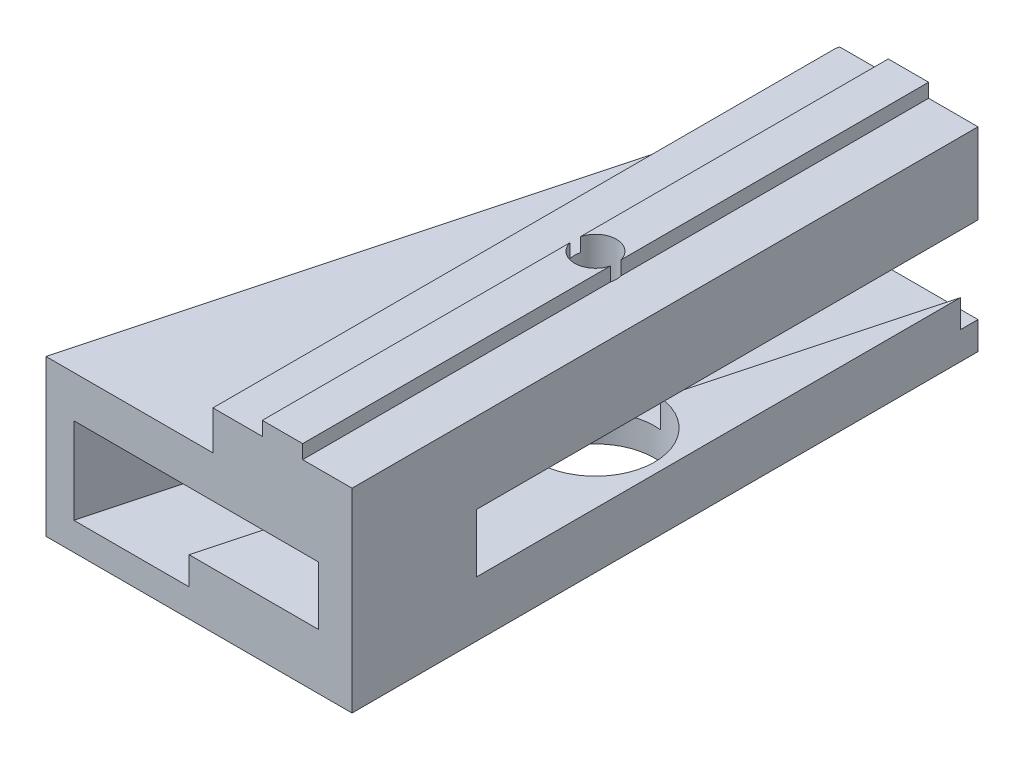
ISO-10303-21;
HEADER;
FILE_DESCRIPTION(('STEP AP214'),'2;1');
FILE_NAME('part.step','',(''),(''),'','','');
FILE_SCHEMA(('AUTOMOTIVE_DESIGN { 1 0 10303 214 1 1 1 1 }'));
ENDSEC;
DATA;
#1=APPLICATION_CONTEXT('core data for automotive mechanical design processes');
#2=APPLICATION_PROTOCOL_DEFINITION('international standard','automotive_design',2000,#1);
#3=PRODUCT_CONTEXT('',#1,'mechanical');
#4=PRODUCT('Part','Part','',(#3));
#5=PRODUCT_RELATED_PRODUCT_CATEGORY('part','',(#4));
#6=PRODUCT_DEFINITION_FORMATION('','',#4);
#7=PRODUCT_DEFINITION_CONTEXT('part definition',#1,'design');
#8=PRODUCT_DEFINITION('design','',#6,#7);
#9=PRODUCT_DEFINITION_SHAPE('','',#8);
#10=(LENGTH_UNIT() NAMED_UNIT(*) SI_UNIT(.MILLI.,.METRE.));
#11=(NAMED_UNIT(*) PLANE_ANGLE_UNIT() SI_UNIT($,.RADIAN.));
#12=(NAMED_UNIT(*) SI_UNIT($,.STERADIAN.) SOLID_ANGLE_UNIT());
#13=UNCERTAINTY_MEASURE_WITH_UNIT(LENGTH_MEASURE(1.E-05),#10,'distance_accuracy_value','');
#14=(GEOMETRIC_REPRESENTATION_CONTEXT(3) GLOBAL_UNCERTAINTY_ASSIGNED_CONTEXT((#13)) GLOBAL_UNIT_ASSIGNED_CONTEXT((#10,
#11,#12)) REPRESENTATION_CONTEXT('',''));
#15=CARTESIAN_POINT('',(0.,0.,0.));
#16=DIRECTION('',(0.,0.,1.));
#17=DIRECTION('',(1.,0.,0.));
#18=AXIS2_PLACEMENT_3D('',#15,#16,#17);
#19=CARTESIAN_POINT('',(11.,0.,22.5));
#20=DIRECTION('',(-1.,0.,0.));
#21=DIRECTION('',(0.,0.,1.));
#22=AXIS2_PLACEMENT_3D('',#19,#20,#21);
#23=PLANE('',#22);
#24=DIRECTION('',(0.,1.,0.));
#25=VECTOR('',#24,1.);
#26=CARTESIAN_POINT('',(11.,0.,-22.5));
#27=LINE('',#26,#25);
#28=CARTESIAN_POINT('',(11.,0.,-22.5));
#29=VERTEX_POINT('',#28);
#30=CARTESIAN_POINT('',(11.,2.,-22.5));
#31=VERTEX_POINT('',#30);
#32=EDGE_CURVE('E304',#29,#31,#27,.T.);
#33=ORIENTED_EDGE('',*,*,#32,.T.);
#34=DIRECTION('',(0.,0.,1.));
#35=VECTOR('',#34,1.);
#36=CARTESIAN_POINT('',(11.,2.,22.5));
#37=LINE('',#36,#35);
#38=CARTESIAN_POINT('',(11.,2.,-21.2313897101272));
#39=VERTEX_POINT('',#38);
#40=EDGE_CURVE('E217',#31,#39,#37,.T.);
#41=ORIENTED_EDGE('',*,*,#40,.T.);
#42=DIRECTION('',(0.,1.,0.));
#43=VECTOR('',#42,1.);
#44=CARTESIAN_POINT('',(11.,0.,-21.2313897101272));
#45=LINE('',#44,#43);
#46=CARTESIAN_POINT('',(11.,4.,-21.2313897101272));
#47=VERTEX_POINT('',#46);
#48=EDGE_CURVE('E384',#39,#47,#45,.T.);
#49=ORIENTED_EDGE('',*,*,#48,.T.);
#50=DIRECTION('',(0.,0.,1.));
#51=VECTOR('',#50,1.);
#52=CARTESIAN_POINT('',(11.,4.,22.5));
#53=LINE('',#52,#51);
#54=CARTESIAN_POINT('',(11.,4.,13.5419400362791));
#55=VERTEX_POINT('',#54);
#56=EDGE_CURVE('E242',#47,#55,#53,.T.);
#57=ORIENTED_EDGE('',*,*,#56,.T.);
#58=DIRECTION('',(0.,-1.,0.));
#59=VECTOR('',#58,1.);
#60=CARTESIAN_POINT('',(11.,0.,13.5419400362791));
#61=LINE('',#60,#59);
#62=CARTESIAN_POINT('',(11.,8.2,13.5419400362791));
#63=VERTEX_POINT('',#62);
#64=EDGE_CURVE('E253',#63,#55,#61,.T.);
#65=ORIENTED_EDGE('',*,*,#64,.F.);
#66=DIRECTION('',(0.,0.,1.));
#67=VECTOR('',#66,1.);
#68=CARTESIAN_POINT('',(11.,8.2,22.5));
#69=LINE('',#68,#67);
#70=CARTESIAN_POINT('',(11.,8.2,-22.5));
#71=VERTEX_POINT('',#70);
#72=EDGE_CURVE('E249',#71,#63,#69,.T.);
#73=ORIENTED_EDGE('',*,*,#72,.F.);
#74=CARTESIAN_POINT('',(11.,14.,-22.5));
#75=VERTEX_POINT('',#74);
#76=EDGE_CURVE('E303',#71,#75,#27,.T.);
#77=ORIENTED_EDGE('',*,*,#76,.T.);
#78=DIRECTION('',(0.,0.,-1.));
#79=VECTOR('',#78,1.);
#80=CARTESIAN_POINT('',(11.,14.,22.5));
#81=LINE('',#80,#79);
#82=CARTESIAN_POINT('',(11.,14.,22.5));
#83=VERTEX_POINT('',#82);
#84=EDGE_CURVE('E336',#83,#75,#81,.T.);
#85=ORIENTED_EDGE('',*,*,#84,.F.);
#86=DIRECTION('',(0.,1.,0.));
#87=VECTOR('',#86,1.);
#88=CARTESIAN_POINT('',(11.,0.,22.5));
#89=LINE('',#88,#87);
#90=CARTESIAN_POINT('',(11.,0.,22.5));
#91=VERTEX_POINT('',#90);
#92=EDGE_CURVE('E288',#91,#83,#89,.T.);
#93=ORIENTED_EDGE('',*,*,#92,.F.);
#94=DIRECTION('',(0.,0.,-1.));
#95=VECTOR('',#94,1.);
#96=CARTESIAN_POINT('',(11.,0.,22.5));
#97=LINE('',#96,#95);
#98=EDGE_CURVE('E339',#91,#29,#97,.T.);
#99=ORIENTED_EDGE('',*,*,#98,.T.);
#100=EDGE_LOOP('',(#33,#41,#49,#57,#65,#73,#77,#85,#93,#99));
#101=FACE_BOUND('',#100,.T.);
#102=ADVANCED_FACE('F35',(#101),#23,.F.);
#103=CARTESIAN_POINT('',(0.,0.,22.5));
#104=DIRECTION('',(0.,0.,1.));
#105=DIRECTION('',(1.,0.,0.));
#106=AXIS2_PLACEMENT_3D('',#103,#104,#105);
#107=PLANE('',#106);
#108=DIRECTION('',(0.,1.,0.));
#109=VECTOR('',#108,1.);
#110=CARTESIAN_POINT('',(-0.717790556719333,0.,22.5));
#111=LINE('',#110,#109);
#112=CARTESIAN_POINT('',(-0.717790556719331,2.,22.5));
#113=VERTEX_POINT('',#112);
#114=CARTESIAN_POINT('',(-0.717790556719333,4.,22.5));
#115=VERTEX_POINT('',#114);
#116=EDGE_CURVE('E50',#113,#115,#111,.T.);
#117=ORIENTED_EDGE('',*,*,#116,.F.);
#118=DIRECTION('',(1.,0.,0.));
#119=VECTOR('',#118,1.);
#120=CARTESIAN_POINT('',(0.,2.,22.5));
#121=LINE('',#120,#119);
#122=CARTESIAN_POINT('',(-9.,2.,22.5));
#123=VERTEX_POINT('',#122);
#124=EDGE_CURVE('E207',#123,#113,#121,.T.);
#125=ORIENTED_EDGE('',*,*,#124,.F.);
#126=DIRECTION('',(0.,-1.,0.));
#127=VECTOR('',#126,1.);
#128=CARTESIAN_POINT('',(-9.,8.2,22.5));
#129=LINE('',#128,#127);
#130=CARTESIAN_POINT('',(-9.,8.2,22.5));
#131=VERTEX_POINT('',#130);
#132=EDGE_CURVE('E192',#131,#123,#129,.T.);
#133=ORIENTED_EDGE('',*,*,#132,.F.);
#134=DIRECTION('',(1.,0.,0.));
#135=VECTOR('',#134,1.);
#136=CARTESIAN_POINT('',(0.,8.2,22.5));
#137=LINE('',#136,#135);
#138=CARTESIAN_POINT('',(8.59969506697142,8.2,22.5));
#139=VERTEX_POINT('',#138);
#140=EDGE_CURVE('E251',#131,#139,#137,.T.);
#141=ORIENTED_EDGE('',*,*,#140,.T.);
#142=DIRECTION('',(0.,-1.,0.));
#143=VECTOR('',#142,1.);
#144=CARTESIAN_POINT('',(8.59969506697141,0.,22.5));
#145=LINE('',#144,#143);
#146=CARTESIAN_POINT('',(8.59969506697142,4.,22.5));
#147=VERTEX_POINT('',#146);
#148=EDGE_CURVE('E353',#139,#147,#145,.T.);
#149=ORIENTED_EDGE('',*,*,#148,.T.);
#150=DIRECTION('',(1.,0.,0.));
#151=VECTOR('',#150,1.);
#152=CARTESIAN_POINT('',(0.,4.,22.5));
#153=LINE('',#152,#151);
#154=EDGE_CURVE('E244',#115,#147,#153,.T.);
#155=ORIENTED_EDGE('',*,*,#154,.F.);
#156=EDGE_LOOP('',(#117,#125,#133,#141,#149,#155));
#157=FACE_BOUND('',#156,.T.);
#158=DIRECTION('',(0.,1.,0.));
#159=VECTOR('',#158,1.);
#160=CARTESIAN_POINT('',(0.999999999999999,14.,22.5));
#161=LINE('',#160,#159);
#162=CARTESIAN_POINT('',(1.,11.2,22.5));
#163=VERTEX_POINT('',#162);
#164=CARTESIAN_POINT('',(0.999999999999999,14.,22.5));
#165=VERTEX_POINT('',#164);
#166=EDGE_CURVE('E219',#163,#165,#161,.T.);
#167=ORIENTED_EDGE('',*,*,#166,.F.);
#168=DIRECTION('',(1.,0.,0.));
#169=VECTOR('',#168,1.);
#170=CARTESIAN_POINT('',(-11.,11.2,22.5));
#171=LINE('',#170,#169);
#172=CARTESIAN_POINT('',(-11.,11.2,22.5));
#173=VERTEX_POINT('',#172);
#174=EDGE_CURVE('E216',#173,#163,#171,.T.);
#175=ORIENTED_EDGE('',*,*,#174,.F.);
#176=DIRECTION('',(0.,-1.,0.));
#177=VECTOR('',#176,1.);
#178=CARTESIAN_POINT('',(-11.,14.,22.5));
#179=LINE('',#178,#177);
#180=CARTESIAN_POINT('',(-11.,0.,22.5));
#181=VERTEX_POINT('',#180);
#182=EDGE_CURVE('E283',#173,#181,#179,.T.);
#183=ORIENTED_EDGE('',*,*,#182,.T.);
#184=DIRECTION('',(1.,0.,0.));
#185=VECTOR('',#184,1.);
#186=CARTESIAN_POINT('',(-11.,0.,22.5));
#187=LINE('',#186,#185);
#188=EDGE_CURVE('E285',#181,#91,#187,.T.);
#189=ORIENTED_EDGE('',*,*,#188,.T.);
#190=ORIENTED_EDGE('',*,*,#92,.T.);
#191=DIRECTION('',(-1.,0.,0.));
#192=VECTOR('',#191,1.);
#193=CARTESIAN_POINT('',(11.,14.,22.5));
#194=LINE('',#193,#192);
#195=CARTESIAN_POINT('',(7.45,14.,22.5));
#196=VERTEX_POINT('',#195);
#197=EDGE_CURVE('E290',#83,#196,#194,.T.);
#198=ORIENTED_EDGE('',*,*,#197,.T.);
#199=DIRECTION('',(0.,1.,0.));
#200=VECTOR('',#199,1.);
#201=CARTESIAN_POINT('',(7.45,14.,22.5));
#202=LINE('',#201,#200);
#203=CARTESIAN_POINT('',(7.45,15.,22.5));
#204=VERTEX_POINT('',#203);
#205=EDGE_CURVE('E292',#196,#204,#202,.T.);
#206=ORIENTED_EDGE('',*,*,#205,.T.);
#207=DIRECTION('',(-1.,0.,0.));
#208=VECTOR('',#207,1.);
#209=CARTESIAN_POINT('',(7.45,15.,22.5));
#210=LINE('',#209,#208);
#211=CARTESIAN_POINT('',(4.55,15.,22.5));
#212=VERTEX_POINT('',#211);
#213=EDGE_CURVE('E294',#204,#212,#210,.T.);
#214=ORIENTED_EDGE('',*,*,#213,.T.);
#215=DIRECTION('',(0.,-1.,0.));
#216=VECTOR('',#215,1.);
#217=CARTESIAN_POINT('',(4.55,15.,22.5));
#218=LINE('',#217,#216);
#219=CARTESIAN_POINT('',(4.55,14.,22.5));
#220=VERTEX_POINT('',#219);
#221=EDGE_CURVE('E296',#212,#220,#218,.T.);
#222=ORIENTED_EDGE('',*,*,#221,.T.);
#223=DIRECTION('',(-1.,0.,0.));
#224=VECTOR('',#223,1.);
#225=CARTESIAN_POINT('',(4.55,14.,22.5));
#226=LINE('',#225,#224);
#227=EDGE_CURVE('E298',#220,#165,#226,.T.);
#228=ORIENTED_EDGE('',*,*,#227,.T.);
#229=EDGE_LOOP('',(#167,#175,#183,#189,#190,#198,#206,#214,#222,#228));
#230=FACE_BOUND('',#229,.T.);
#231=ADVANCED_FACE('F213',(#157,#230),#107,.T.);
#232=CARTESIAN_POINT('',(0.,0.,-22.5));
#233=DIRECTION('',(0.,0.,1.));
#234=DIRECTION('',(1.,0.,0.));
#235=AXIS2_PLACEMENT_3D('',#232,#233,#234);
#236=PLANE('',#235);
#237=DIRECTION('',(0.,1.,0.));
#238=VECTOR('',#237,1.);
#239=CARTESIAN_POINT('',(3.05771365940056,0.,-22.5));
#240=LINE('',#239,#238);
#241=CARTESIAN_POINT('',(3.05771365940056,2.,-22.5));
#242=VERTEX_POINT('',#241);
#243=CARTESIAN_POINT('',(3.05771365940055,8.2,-22.5));
#244=VERTEX_POINT('',#243);
#245=EDGE_CURVE('E345',#242,#244,#240,.T.);
#246=ORIENTED_EDGE('',*,*,#245,.F.);
#247=DIRECTION('',(1.,0.,0.));
#248=VECTOR('',#247,1.);
#249=CARTESIAN_POINT('',(0.,2.,-22.5));
#250=LINE('',#249,#248);
#251=EDGE_CURVE('E209',#242,#31,#250,.T.);
#252=ORIENTED_EDGE('',*,*,#251,.T.);
#253=ORIENTED_EDGE('',*,*,#32,.F.);
#254=DIRECTION('',(1.,0.,0.));
#255=VECTOR('',#254,1.);
#256=CARTESIAN_POINT('',(-11.,0.,-22.5));
#257=LINE('',#256,#255);
#258=CARTESIAN_POINT('',(1.05771365940055,0.,-22.5));
#259=VERTEX_POINT('',#258);
#260=EDGE_CURVE('E282',#259,#29,#257,.T.);
#261=ORIENTED_EDGE('',*,*,#260,.F.);
#262=DIRECTION('',(0.,-1.,0.));
#263=VECTOR('',#262,1.);
#264=CARTESIAN_POINT('',(1.05771365940055,15.,-22.5));
#265=LINE('',#264,#263);
#266=CARTESIAN_POINT('',(1.05771365940055,14.,-22.5));
#267=VERTEX_POINT('',#266);
#268=EDGE_CURVE('E233',#267,#259,#265,.T.);
#269=ORIENTED_EDGE('',*,*,#268,.F.);
#270=DIRECTION('',(-1.,0.,0.));
#271=VECTOR('',#270,1.);
#272=CARTESIAN_POINT('',(4.55,14.,-22.5));
#273=LINE('',#272,#271);
#274=CARTESIAN_POINT('',(4.55,14.,-22.5));
#275=VERTEX_POINT('',#274);
#276=EDGE_CURVE('E286',#275,#267,#273,.T.);
#277=ORIENTED_EDGE('',*,*,#276,.F.);
#278=DIRECTION('',(0.,-1.,0.));
#279=VECTOR('',#278,1.);
#280=CARTESIAN_POINT('',(4.55,15.,-22.5));
#281=LINE('',#280,#279);
#282=CARTESIAN_POINT('',(4.55,15.,-22.5));
#283=VERTEX_POINT('',#282);
#284=EDGE_CURVE('E316',#283,#275,#281,.T.);
#285=ORIENTED_EDGE('',*,*,#284,.F.);
#286=DIRECTION('',(-1.,0.,0.));
#287=VECTOR('',#286,1.);
#288=CARTESIAN_POINT('',(7.45,15.,-22.5));
#289=LINE('',#288,#287);
#290=CARTESIAN_POINT('',(7.45,15.,-22.5));
#291=VERTEX_POINT('',#290);
#292=EDGE_CURVE('E313',#291,#283,#289,.T.);
#293=ORIENTED_EDGE('',*,*,#292,.F.);
#294=DIRECTION('',(0.,1.,0.));
#295=VECTOR('',#294,1.);
#296=CARTESIAN_POINT('',(7.45,14.,-22.5));
#297=LINE('',#296,#295);
#298=CARTESIAN_POINT('',(7.45,14.,-22.5));
#299=VERTEX_POINT('',#298);
#300=EDGE_CURVE('E310',#299,#291,#297,.T.);
#301=ORIENTED_EDGE('',*,*,#300,.F.);
#302=DIRECTION('',(-1.,0.,0.));
#303=VECTOR('',#302,1.);
#304=CARTESIAN_POINT('',(11.,14.,-22.5));
#305=LINE('',#304,#303);
#306=EDGE_CURVE('E307',#75,#299,#305,.T.);
#307=ORIENTED_EDGE('',*,*,#306,.F.);
#308=ORIENTED_EDGE('',*,*,#76,.F.);
#309=DIRECTION('',(1.,0.,0.));
#310=VECTOR('',#309,1.);
#311=CARTESIAN_POINT('',(0.,8.2,-22.5));
#312=LINE('',#311,#310);
#313=EDGE_CURVE('E247',#244,#71,#312,.T.);
#314=ORIENTED_EDGE('',*,*,#313,.F.);
#315=EDGE_LOOP('',(#246,#252,#253,#261,#269,#277,#285,#293,#301,#307,#308,#314));
#316=FACE_BOUND('',#315,.T.);
#317=ADVANCED_FACE('F387',(#316),#236,.F.);
#318=CARTESIAN_POINT('',(6.,0.,0.));
#319=DIRECTION('',(0.,1.,0.));
#320=DIRECTION('',(-1.,0.,0.));
#321=AXIS2_PLACEMENT_3D('',#318,#319,#320);
#322=CYLINDRICAL_SURFACE('',#321,4.25);
#323=CARTESIAN_POINT('',(6.,11.,0.));
#324=DIRECTION('',(0.,1.,0.));
#325=DIRECTION('',(-1.,0.,0.));
#326=AXIS2_PLACEMENT_3D('',#323,#324,#325);
#327=CIRCLE('',#326,4.25);
#328=CARTESIAN_POINT('',(1.75,11.,0.));
#329=VERTEX_POINT('',#328);
#330=EDGE_CURVE('E256',#329,#329,#327,.T.);
#331=ORIENTED_EDGE('',*,*,#330,.T.);
#332=EDGE_LOOP('',(#331));
#333=FACE_BOUND('',#332,.T.);
#334=CARTESIAN_POINT('',(6.,8.2,0.));
#335=DIRECTION('',(0.,-1.,0.));
#336=DIRECTION('',(0.,0.,-1.));
#337=AXIS2_PLACEMENT_3D('',#334,#335,#336);
#338=CIRCLE('',#337,4.25);
#339=CARTESIAN_POINT('',(6.,8.2,-4.25));
#340=VERTEX_POINT('',#339);
#341=EDGE_CURVE('E246',#340,#340,#338,.F.);
#342=ORIENTED_EDGE('',*,*,#341,.F.);
#343=EDGE_LOOP('',(#342));
#344=FACE_BOUND('',#343,.T.);
#345=ADVANCED_FACE('F438',(#333,#344),#322,.F.);
#346=CARTESIAN_POINT('',(7.45,14.,22.5));
#347=DIRECTION('',(-1.,0.,0.));
#348=DIRECTION('',(0.,0.,1.));
#349=AXIS2_PLACEMENT_3D('',#346,#347,#348);
#350=PLANE('',#349);
#351=DIRECTION('',(0.,0.,-1.));
#352=VECTOR('',#351,1.);
#353=CARTESIAN_POINT('',(7.45,15.,22.5));
#354=LINE('',#353,#352);
#355=CARTESIAN_POINT('',(7.45,15.,-0.384057287393428));
#356=VERTEX_POINT('',#355);
#357=EDGE_CURVE('E328',#356,#291,#354,.T.);
#358=ORIENTED_EDGE('',*,*,#357,.F.);
#359=DIRECTION('',(0.,-1.,0.));
#360=VECTOR('',#359,1.);
#361=CARTESIAN_POINT('',(7.45,15.,-0.384057287393427));
#362=LINE('',#361,#360);
#363=CARTESIAN_POINT('',(7.45,14.,-0.384057287393428));
#364=VERTEX_POINT('',#363);
#365=EDGE_CURVE('E279',#356,#364,#362,.T.);
#366=ORIENTED_EDGE('',*,*,#365,.T.);
#367=DIRECTION('',(0.,0.,-1.));
#368=VECTOR('',#367,1.);
#369=CARTESIAN_POINT('',(7.45,14.,22.5));
#370=LINE('',#369,#368);
#371=EDGE_CURVE('E332',#364,#299,#370,.T.);
#372=ORIENTED_EDGE('',*,*,#371,.T.);
#373=ORIENTED_EDGE('',*,*,#300,.T.);
#374=EDGE_LOOP('',(#358,#366,#372,#373));
#375=FACE_BOUND('',#374,.T.);
#376=ADVANCED_FACE('F415',(#375),#350,.F.);
#377=CARTESIAN_POINT('',(7.45,15.,22.5));
#378=DIRECTION('',(0.,-1.,0.));
#379=DIRECTION('',(0.,0.,-1.));
#380=AXIS2_PLACEMENT_3D('',#377,#378,#379);
#381=PLANE('',#380);
#382=CARTESIAN_POINT('',(7.45,15.,0.384057287393428));
#383=VERTEX_POINT('',#382);
#384=EDGE_CURVE('E329',#204,#383,#354,.T.);
#385=ORIENTED_EDGE('',*,*,#384,.T.);
#386=CARTESIAN_POINT('',(6.,15.,0.));
#387=DIRECTION('',(0.,-1.,0.));
#388=DIRECTION('',(1.,0.,0.));
#389=AXIS2_PLACEMENT_3D('',#386,#387,#388);
#390=CIRCLE('',#389,1.5);
#391=CARTESIAN_POINT('',(4.55,15.,0.38405728739344));
#392=VERTEX_POINT('',#391);
#393=EDGE_CURVE('E263',#383,#392,#390,.T.);
#394=ORIENTED_EDGE('',*,*,#393,.T.);
#395=DIRECTION('',(0.,0.,-1.));
#396=VECTOR('',#395,1.);
#397=CARTESIAN_POINT('',(4.55,15.,22.5));
#398=LINE('',#397,#396);
#399=EDGE_CURVE('E325',#212,#392,#398,.T.);
#400=ORIENTED_EDGE('',*,*,#399,.F.);
#401=ORIENTED_EDGE('',*,*,#213,.F.);
#402=EDGE_LOOP('',(#385,#394,#400,#401));
#403=FACE_BOUND('',#402,.T.);
#404=ADVANCED_FACE('F454',(#403),#381,.F.);
#405=CARTESIAN_POINT('',(4.55,15.,22.5));
#406=DIRECTION('',(1.,0.,0.));
#407=DIRECTION('',(0.,0.,-1.));
#408=AXIS2_PLACEMENT_3D('',#405,#406,#407);
#409=PLANE('',#408);
#410=ORIENTED_EDGE('',*,*,#399,.T.);
#411=DIRECTION('',(0.,-1.,0.));
#412=VECTOR('',#411,1.);
#413=CARTESIAN_POINT('',(4.55,15.,0.38405728739344));
#414=LINE('',#413,#412);
#415=CARTESIAN_POINT('',(4.55,14.,0.384057287393441));
#416=VERTEX_POINT('',#415);
#417=EDGE_CURVE('E270',#392,#416,#414,.T.);
#418=ORIENTED_EDGE('',*,*,#417,.T.);
#419=DIRECTION('',(0.,0.,-1.));
#420=VECTOR('',#419,1.);
#421=CARTESIAN_POINT('',(4.55,14.,22.5));
#422=LINE('',#421,#420);
#423=EDGE_CURVE('E321',#220,#416,#422,.T.);
#424=ORIENTED_EDGE('',*,*,#423,.F.);
#425=ORIENTED_EDGE('',*,*,#221,.F.);
#426=EDGE_LOOP('',(#410,#418,#424,#425));
#427=FACE_BOUND('',#426,.T.);
#428=ADVANCED_FACE('F457',(#427),#409,.F.);
#429=CARTESIAN_POINT('',(-11.,0.,22.5));
#430=DIRECTION('',(0.,1.,0.));
#431=DIRECTION('',(-1.,0.,0.));
#432=AXIS2_PLACEMENT_3D('',#429,#430,#431);
#433=PLANE('',#432);
#434=CARTESIAN_POINT('',(6.,0.,0.));
#435=DIRECTION('',(0.,1.,0.));
#436=DIRECTION('',(-1.,0.,0.));
#437=AXIS2_PLACEMENT_3D('',#434,#435,#436);
#438=CIRCLE('',#437,4.25);
#439=CARTESIAN_POINT('',(1.75,0.,0.));
#440=VERTEX_POINT('',#439);
#441=EDGE_CURVE('E257',#440,#440,#438,.T.);
#442=ORIENTED_EDGE('',*,*,#441,.T.);
#443=EDGE_LOOP('',(#442));
#444=FACE_BOUND('',#443,.T.);
#445=ORIENTED_EDGE('',*,*,#188,.F.);
#446=DIRECTION('',(-0.258819045102521,0.,0.965925826289068));
#447=VECTOR('',#446,1.);
#448=CARTESIAN_POINT('',(1.05771365940055,0.,-22.5));
#449=LINE('',#448,#447);
#450=EDGE_CURVE('E229',#259,#181,#449,.T.);
#451=ORIENTED_EDGE('',*,*,#450,.F.);
#452=ORIENTED_EDGE('',*,*,#260,.T.);
#453=ORIENTED_EDGE('',*,*,#98,.F.);
#454=EDGE_LOOP('',(#445,#451,#452,#453));
#455=FACE_BOUND('',#454,.T.);
#456=ADVANCED_FACE('F37',(#444,#455),#433,.F.);
#457=CARTESIAN_POINT('',(11.,14.,22.5));
#458=DIRECTION('',(0.,-1.,0.));
#459=DIRECTION('',(0.,0.,-1.));
#460=AXIS2_PLACEMENT_3D('',#457,#458,#459);
#461=PLANE('',#460);
#462=ORIENTED_EDGE('',*,*,#371,.F.);
#463=CARTESIAN_POINT('',(6.,14.,0.));
#464=DIRECTION('',(0.,-1.,0.));
#465=DIRECTION('',(0.,0.,-1.));
#466=AXIS2_PLACEMENT_3D('',#463,#464,#465);
#467=CIRCLE('',#466,1.5);
#468=CARTESIAN_POINT('',(7.45,14.,0.384057287393427));
#469=VERTEX_POINT('',#468);
#470=EDGE_CURVE('E276',#364,#469,#467,.T.);
#471=ORIENTED_EDGE('',*,*,#470,.T.);
#472=EDGE_CURVE('E333',#196,#469,#370,.T.);
#473=ORIENTED_EDGE('',*,*,#472,.F.);
#474=ORIENTED_EDGE('',*,*,#197,.F.);
#475=ORIENTED_EDGE('',*,*,#84,.T.);
#476=ORIENTED_EDGE('',*,*,#306,.T.);
#477=EDGE_LOOP('',(#462,#471,#473,#474,#475,#476));
#478=FACE_BOUND('',#477,.T.);
#479=ADVANCED_FACE('F418',(#478),#461,.F.);
#480=ORIENTED_EDGE('',*,*,#472,.T.);
#481=DIRECTION('',(0.,-1.,0.));
#482=VECTOR('',#481,1.);
#483=CARTESIAN_POINT('',(7.45,15.,0.384057287393427));
#484=LINE('',#483,#482);
#485=EDGE_CURVE('E273',#469,#383,#484,.F.);
#486=ORIENTED_EDGE('',*,*,#485,.T.);
#487=ORIENTED_EDGE('',*,*,#384,.F.);
#488=ORIENTED_EDGE('',*,*,#205,.F.);
#489=EDGE_LOOP('',(#480,#486,#487,#488));
#490=FACE_BOUND('',#489,.T.);
#491=ADVANCED_FACE('F448',(#490),#350,.F.);
#492=CARTESIAN_POINT('',(4.55,15.,-0.38405728739344));
#493=VERTEX_POINT('',#492);
#494=EDGE_CURVE('E324',#493,#283,#398,.T.);
#495=ORIENTED_EDGE('',*,*,#494,.F.);
#496=EDGE_CURVE('E267',#493,#356,#390,.T.);
#497=ORIENTED_EDGE('',*,*,#496,.T.);
#498=ORIENTED_EDGE('',*,*,#357,.T.);
#499=ORIENTED_EDGE('',*,*,#292,.T.);
#500=EDGE_LOOP('',(#495,#497,#498,#499));
#501=FACE_BOUND('',#500,.T.);
#502=ADVANCED_FACE('F411',(#501),#381,.F.);
#503=CARTESIAN_POINT('',(4.55,14.,-0.384057287393441));
#504=VERTEX_POINT('',#503);
#505=EDGE_CURVE('E301',#504,#275,#422,.T.);
#506=ORIENTED_EDGE('',*,*,#505,.F.);
#507=DIRECTION('',(0.,-1.,0.));
#508=VECTOR('',#507,1.);
#509=CARTESIAN_POINT('',(4.55,15.,-0.38405728739344));
#510=LINE('',#509,#508);
#511=EDGE_CURVE('E266',#504,#493,#510,.F.);
#512=ORIENTED_EDGE('',*,*,#511,.T.);
#513=ORIENTED_EDGE('',*,*,#494,.T.);
#514=ORIENTED_EDGE('',*,*,#284,.T.);
#515=EDGE_LOOP('',(#506,#512,#513,#514));
#516=FACE_BOUND('',#515,.T.);
#517=ADVANCED_FACE('F405',(#516),#409,.F.);
#518=CARTESIAN_POINT('',(4.55,14.,22.5));
#519=DIRECTION('',(0.,-1.,0.));
#520=DIRECTION('',(1.,0.,0.));
#521=AXIS2_PLACEMENT_3D('',#518,#519,#520);
#522=PLANE('',#521);
#523=DIRECTION('',(-0.258819045102521,0.,0.965925826289068));
#524=VECTOR('',#523,1.);
#525=CARTESIAN_POINT('',(-9.95834751442401,14.,18.6125));
#526=LINE('',#525,#524);
#527=CARTESIAN_POINT('',(0.999999999999999,14.,-22.2846096908264));
#528=VERTEX_POINT('',#527);
#529=EDGE_CURVE('E356',#267,#528,#526,.T.);
#530=ORIENTED_EDGE('',*,*,#529,.T.);
#531=DIRECTION('',(0.,0.,1.));
#532=VECTOR('',#531,1.);
#533=CARTESIAN_POINT('',(0.999999999999999,14.,-22.5));
#534=LINE('',#533,#532);
#535=EDGE_CURVE('E226',#528,#165,#534,.T.);
#536=ORIENTED_EDGE('',*,*,#535,.T.);
#537=ORIENTED_EDGE('',*,*,#227,.F.);
#538=ORIENTED_EDGE('',*,*,#423,.T.);
#539=CARTESIAN_POINT('',(6.,14.,0.));
#540=DIRECTION('',(0.,-1.,0.));
#541=DIRECTION('',(1.,0.,0.));
#542=AXIS2_PLACEMENT_3D('',#539,#540,#541);
#543=CIRCLE('',#542,1.5);
#544=EDGE_CURVE('E342',#416,#504,#543,.T.);
#545=ORIENTED_EDGE('',*,*,#544,.T.);
#546=ORIENTED_EDGE('',*,*,#505,.T.);
#547=ORIENTED_EDGE('',*,*,#276,.T.);
#548=EDGE_LOOP('',(#530,#536,#537,#538,#545,#546,#547));
#549=FACE_BOUND('',#548,.T.);
#550=ADVANCED_FACE('F402',(#549),#522,.F.);
#551=CARTESIAN_POINT('',(6.,15.,0.));
#552=DIRECTION('',(0.,-1.,0.));
#553=DIRECTION('',(1.,0.,0.));
#554=AXIS2_PLACEMENT_3D('',#551,#552,#553);
#555=CYLINDRICAL_SURFACE('',#554,1.5);
#556=CARTESIAN_POINT('',(6.,11.,0.));
#557=DIRECTION('',(0.,1.,0.));
#558=DIRECTION('',(-1.,0.,0.));
#559=AXIS2_PLACEMENT_3D('',#556,#557,#558);
#560=CIRCLE('',#559,1.5);
#561=CARTESIAN_POINT('',(4.5,11.,0.));
#562=VERTEX_POINT('',#561);
#563=EDGE_CURVE('E260',#562,#562,#560,.F.);
#564=ORIENTED_EDGE('',*,*,#563,.T.);
#565=EDGE_LOOP('',(#564));
#566=FACE_BOUND('',#565,.T.);
#567=ORIENTED_EDGE('',*,*,#496,.F.);
#568=ORIENTED_EDGE('',*,*,#511,.F.);
#569=ORIENTED_EDGE('',*,*,#544,.F.);
#570=ORIENTED_EDGE('',*,*,#417,.F.);
#571=ORIENTED_EDGE('',*,*,#393,.F.);
#572=ORIENTED_EDGE('',*,*,#485,.F.);
#573=ORIENTED_EDGE('',*,*,#470,.F.);
#574=ORIENTED_EDGE('',*,*,#365,.F.);
#575=EDGE_LOOP('',(#567,#568,#569,#570,#571,#572,#573,#574));
#576=FACE_BOUND('',#575,.T.);
#577=ADVANCED_FACE('F460',(#566,#576),#555,.F.);
#578=CARTESIAN_POINT('',(6.,11.,0.));
#579=DIRECTION('',(0.,1.,0.));
#580=DIRECTION('',(-1.,0.,0.));
#581=AXIS2_PLACEMENT_3D('',#578,#579,#580);
#582=PLANE('',#581);
#583=ORIENTED_EDGE('',*,*,#330,.F.);
#584=EDGE_LOOP('',(#583));
#585=FACE_BOUND('',#584,.T.);
#586=ORIENTED_EDGE('',*,*,#563,.F.);
#587=EDGE_LOOP('',(#586));
#588=FACE_BOUND('',#587,.T.);
#589=ADVANCED_FACE('F436',(#585,#588),#582,.F.);
#590=CARTESIAN_POINT('',(6.,4.,0.));
#591=DIRECTION('',(0.,-1.,0.));
#592=DIRECTION('',(0.,0.,-1.));
#593=AXIS2_PLACEMENT_3D('',#590,#591,#592);
#594=CIRCLE('',#593,4.25);
#595=CARTESIAN_POINT('',(4.27080284698699,4.,3.88231595906511));
#596=VERTEX_POINT('',#595);
#597=CARTESIAN_POINT('',(6.44362931687156,4.,-4.22678282257465));
#598=VERTEX_POINT('',#597);
#599=EDGE_CURVE('E201',#596,#598,#594,.F.);
#600=ORIENTED_EDGE('',*,*,#599,.T.);
#601=DIRECTION('',(0.,1.,0.));
#602=VECTOR('',#601,1.);
#603=CARTESIAN_POINT('',(6.44362931687157,0.,-4.22678282257464));
#604=LINE('',#603,#602);
#605=CARTESIAN_POINT('',(6.44362931687157,2.,-4.22678282257465));
#606=VERTEX_POINT('',#605);
#607=EDGE_CURVE('E377',#598,#606,#604,.F.);
#608=ORIENTED_EDGE('',*,*,#607,.T.);
#609=CARTESIAN_POINT('',(6.,2.,0.));
#610=DIRECTION('',(0.,-1.,0.));
#611=DIRECTION('',(0.,0.,-1.));
#612=AXIS2_PLACEMENT_3D('',#609,#610,#611);
#613=CIRCLE('',#612,4.25);
#614=CARTESIAN_POINT('',(4.27080284698699,2.,3.88231595906511));
#615=VERTEX_POINT('',#614);
#616=EDGE_CURVE('E11',#606,#615,#613,.F.);
#617=ORIENTED_EDGE('',*,*,#616,.T.);
#618=DIRECTION('',(0.,1.,0.));
#619=VECTOR('',#618,1.);
#620=CARTESIAN_POINT('',(4.27080284698699,0.,3.88231595906511));
#621=LINE('',#620,#619);
#622=EDGE_CURVE('E210',#615,#596,#621,.T.);
#623=ORIENTED_EDGE('',*,*,#622,.T.);
#624=EDGE_LOOP('',(#600,#608,#617,#623));
#625=FACE_BOUND('',#624,.T.);
#626=ORIENTED_EDGE('',*,*,#441,.F.);
#627=EDGE_LOOP('',(#626));
#628=FACE_BOUND('',#627,.T.);
#629=ADVANCED_FACE('F375',(#625,#628),#322,.F.);
#630=CARTESIAN_POINT('',(20.0104850090698,8.2,-20.085647818407));
#631=DIRECTION('',(-0.965925826289068,0.,-0.258819045102521));
#632=DIRECTION('',(-0.258819045102521,0.,0.965925826289068));
#633=AXIS2_PLACEMENT_3D('',#630,#631,#632);
#634=PLANE('',#633);
#635=ORIENTED_EDGE('',*,*,#64,.T.);
#636=DIRECTION('',(0.258819045102521,0.,-0.965925826289068));
#637=VECTOR('',#636,1.);
#638=CARTESIAN_POINT('',(20.0104850090698,4.,-20.085647818407));
#639=LINE('',#638,#637);
#640=EDGE_CURVE('E235',#147,#55,#639,.T.);
#641=ORIENTED_EDGE('',*,*,#640,.F.);
#642=ORIENTED_EDGE('',*,*,#148,.F.);
#643=DIRECTION('',(0.258819045102521,0.,-0.965925826289068));
#644=VECTOR('',#643,1.);
#645=CARTESIAN_POINT('',(20.0104850090698,8.2,-20.085647818407));
#646=LINE('',#645,#644);
#647=EDGE_CURVE('E236',#139,#63,#646,.T.);
#648=ORIENTED_EDGE('',*,*,#647,.T.);
#649=EDGE_LOOP('',(#635,#641,#642,#648));
#650=FACE_BOUND('',#649,.T.);
#651=ADVANCED_FACE('F427',(#650),#634,.T.);
#652=CARTESIAN_POINT('',(-9.,8.2,22.5));
#653=DIRECTION('',(0.965925826289068,0.,0.258819045102521));
#654=DIRECTION('',(0.258819045102521,0.,-0.965925826289068));
#655=AXIS2_PLACEMENT_3D('',#652,#653,#654);
#656=PLANE('',#655);
#657=ORIENTED_EDGE('',*,*,#245,.T.);
#658=DIRECTION('',(-0.258819045102521,0.,0.965925826289068));
#659=VECTOR('',#658,1.);
#660=CARTESIAN_POINT('',(-9.,8.2,22.5));
#661=LINE('',#660,#659);
#662=EDGE_CURVE('E197',#244,#131,#661,.T.);
#663=ORIENTED_EDGE('',*,*,#662,.T.);
#664=ORIENTED_EDGE('',*,*,#132,.T.);
#665=DIRECTION('',(-0.258819045102521,0.,0.965925826289068));
#666=VECTOR('',#665,1.);
#667=CARTESIAN_POINT('',(3.58974596215565,2.,-24.4855715851499));
#668=LINE('',#667,#666);
#669=EDGE_CURVE('E195',#242,#123,#668,.T.);
#670=ORIENTED_EDGE('',*,*,#669,.F.);
#671=EDGE_LOOP('',(#657,#663,#664,#670));
#672=FACE_BOUND('',#671,.T.);
#673=ADVANCED_FACE('F194',(#672),#656,.T.);
#674=CARTESIAN_POINT('',(0.,8.2,0.));
#675=DIRECTION('',(0.,-1.,0.));
#676=DIRECTION('',(0.,0.,-1.));
#677=AXIS2_PLACEMENT_3D('',#674,#675,#676);
#678=PLANE('',#677);
#679=ORIENTED_EDGE('',*,*,#341,.T.);
#680=EDGE_LOOP('',(#679));
#681=FACE_BOUND('',#680,.T.);
#682=ORIENTED_EDGE('',*,*,#662,.F.);
#683=ORIENTED_EDGE('',*,*,#313,.T.);
#684=ORIENTED_EDGE('',*,*,#72,.T.);
#685=ORIENTED_EDGE('',*,*,#647,.F.);
#686=ORIENTED_EDGE('',*,*,#140,.F.);
#687=EDGE_LOOP('',(#682,#683,#684,#685,#686));
#688=FACE_BOUND('',#687,.T.);
#689=ADVANCED_FACE('F425',(#681,#688),#678,.T.);
#690=CARTESIAN_POINT('',(0.,4.,0.));
#691=DIRECTION('',(0.,-1.,0.));
#692=DIRECTION('',(0.,0.,-1.));
#693=AXIS2_PLACEMENT_3D('',#690,#691,#692);
#694=PLANE('',#693);
#695=ORIENTED_EDGE('',*,*,#56,.F.);
#696=DIRECTION('',(-0.258819045102521,0.,0.965925826289068));
#697=VECTOR('',#696,1.);
#698=CARTESIAN_POINT('',(4.95529229328259,4.,1.32776656824524));
#699=LINE('',#698,#697);
#700=EDGE_CURVE('E43',#47,#598,#699,.T.);
#701=ORIENTED_EDGE('',*,*,#700,.T.);
#702=ORIENTED_EDGE('',*,*,#599,.F.);
#703=EDGE_CURVE('E364',#596,#115,#699,.T.);
#704=ORIENTED_EDGE('',*,*,#703,.T.);
#705=ORIENTED_EDGE('',*,*,#154,.T.);
#706=ORIENTED_EDGE('',*,*,#640,.T.);
#707=EDGE_LOOP('',(#695,#701,#702,#704,#705,#706));
#708=FACE_BOUND('',#707,.T.);
#709=ADVANCED_FACE('F369',(#708),#694,.F.);
#710=CARTESIAN_POINT('',(1.05771365940055,15.,-22.5));
#711=DIRECTION('',(0.965925826289068,0.,0.258819045102521));
#712=DIRECTION('',(0.258819045102521,0.,-0.965925826289068));
#713=AXIS2_PLACEMENT_3D('',#710,#711,#712);
#714=PLANE('',#713);
#715=DIRECTION('',(0.258819045102521,0.,-0.965925826289068));
#716=VECTOR('',#715,1.);
#717=CARTESIAN_POINT('',(1.05771365940055,11.2,-22.5));
#718=LINE('',#717,#716);
#719=CARTESIAN_POINT('',(1.,11.2,-22.2846096908264));
#720=VERTEX_POINT('',#719);
#721=EDGE_CURVE('E359',#173,#720,#718,.T.);
#722=ORIENTED_EDGE('',*,*,#721,.T.);
#723=DIRECTION('',(0.,1.,0.));
#724=VECTOR('',#723,1.);
#725=CARTESIAN_POINT('',(0.999999999999999,15.,-22.2846096908264));
#726=LINE('',#725,#724);
#727=EDGE_CURVE('E362',#720,#528,#726,.T.);
#728=ORIENTED_EDGE('',*,*,#727,.T.);
#729=ORIENTED_EDGE('',*,*,#529,.F.);
#730=ORIENTED_EDGE('',*,*,#268,.T.);
#731=ORIENTED_EDGE('',*,*,#450,.T.);
#732=ORIENTED_EDGE('',*,*,#182,.F.);
#733=EDGE_LOOP('',(#722,#728,#729,#730,#731,#732));
#734=FACE_BOUND('',#733,.T.);
#735=ADVANCED_FACE('F481',(#734),#714,.F.);
#736=CARTESIAN_POINT('',(0.999999999999999,14.,-22.5));
#737=DIRECTION('',(1.,0.,0.));
#738=DIRECTION('',(0.,1.,0.));
#739=AXIS2_PLACEMENT_3D('',#736,#737,#738);
#740=PLANE('',#739);
#741=DIRECTION('',(0.,0.,1.));
#742=VECTOR('',#741,1.);
#743=CARTESIAN_POINT('',(1.,11.2,-22.5));
#744=LINE('',#743,#742);
#745=EDGE_CURVE('E58',#720,#163,#744,.T.);
#746=ORIENTED_EDGE('',*,*,#745,.T.);
#747=ORIENTED_EDGE('',*,*,#166,.T.);
#748=ORIENTED_EDGE('',*,*,#535,.F.);
#749=ORIENTED_EDGE('',*,*,#727,.F.);
#750=EDGE_LOOP('',(#746,#747,#748,#749));
#751=FACE_BOUND('',#750,.T.);
#752=ADVANCED_FACE('F483',(#751),#740,.F.);
#753=CARTESIAN_POINT('',(-11.,11.2,-22.5));
#754=DIRECTION('',(0.,-1.,0.));
#755=DIRECTION('',(0.,0.,-1.));
#756=AXIS2_PLACEMENT_3D('',#753,#754,#755);
#757=PLANE('',#756);
#758=ORIENTED_EDGE('',*,*,#174,.T.);
#759=ORIENTED_EDGE('',*,*,#745,.F.);
#760=ORIENTED_EDGE('',*,*,#721,.F.);
#761=EDGE_LOOP('',(#758,#759,#760));
#762=FACE_BOUND('',#761,.T.);
#763=ADVANCED_FACE('F489',(#762),#757,.F.);
#764=CARTESIAN_POINT('',(3.58974596215565,2.,-24.4855715851499));
#765=DIRECTION('',(0.,-1.,0.));
#766=DIRECTION('',(0.,0.,-1.));
#767=AXIS2_PLACEMENT_3D('',#764,#765,#766);
#768=PLANE('',#767);
#769=ORIENTED_EDGE('',*,*,#124,.T.);
#770=DIRECTION('',(-0.258819045102521,0.,0.965925826289068));
#771=VECTOR('',#770,1.);
#772=CARTESIAN_POINT('',(11.3171525724682,2.,-22.4150192243297));
#773=LINE('',#772,#771);
#774=EDGE_CURVE('E381',#615,#113,#773,.T.);
#775=ORIENTED_EDGE('',*,*,#774,.F.);
#776=ORIENTED_EDGE('',*,*,#616,.F.);
#777=EDGE_CURVE('E211',#39,#606,#773,.T.);
#778=ORIENTED_EDGE('',*,*,#777,.F.);
#779=ORIENTED_EDGE('',*,*,#40,.F.);
#780=ORIENTED_EDGE('',*,*,#251,.F.);
#781=ORIENTED_EDGE('',*,*,#669,.T.);
#782=EDGE_LOOP('',(#769,#775,#776,#778,#779,#780,#781));
#783=FACE_BOUND('',#782,.T.);
#784=ADVANCED_FACE('F205',(#783),#768,.F.);
#785=CARTESIAN_POINT('',(11.3171525724682,2.,-22.4150192243297));
#786=DIRECTION('',(0.965925826289068,0.,0.258819045102521));
#787=DIRECTION('',(0.258819045102521,0.,-0.965925826289068));
#788=AXIS2_PLACEMENT_3D('',#785,#786,#787);
#789=PLANE('',#788);
#790=ORIENTED_EDGE('',*,*,#777,.T.);
#791=ORIENTED_EDGE('',*,*,#607,.F.);
#792=ORIENTED_EDGE('',*,*,#700,.F.);
#793=ORIENTED_EDGE('',*,*,#48,.F.);
#794=EDGE_LOOP('',(#790,#791,#792,#793));
#795=FACE_BOUND('',#794,.T.);
#796=ADVANCED_FACE('F521',(#795),#789,.F.);
#797=ORIENTED_EDGE('',*,*,#116,.T.);
#798=ORIENTED_EDGE('',*,*,#703,.F.);
#799=ORIENTED_EDGE('',*,*,#622,.F.);
#800=ORIENTED_EDGE('',*,*,#774,.T.);
#801=EDGE_LOOP('',(#797,#798,#799,#800));
#802=FACE_BOUND('',#801,.T.);
#803=ADVANCED_FACE('F526',(#802),#789,.F.);
#804=CLOSED_SHELL('',(#102,#231,#317,#345,#376,#404,#428,#456,#479,#491,#502,#517,#550,#577,
#589,#629,#651,#673,#689,#709,#735,#752,#763,#784,#796,#803));
#805=MANIFOLD_SOLID_BREP('B2',#804);
#806=ADVANCED_BREP_SHAPE_REPRESENTATION('',(#18,#805),#14);
#807=SHAPE_DEFINITION_REPRESENTATION(#9,#806);
ENDSEC;
END-ISO-10303-21;
